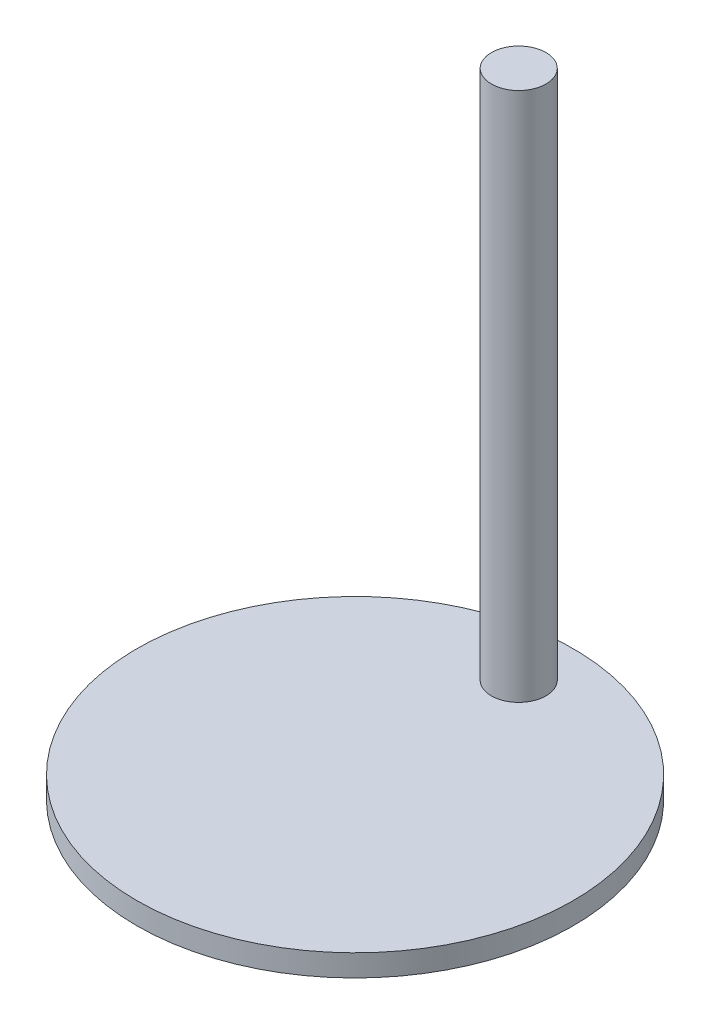
ISO-10303-21;
HEADER;
FILE_DESCRIPTION(('STEP AP214'),'2;1');
FILE_NAME('part.step','',(''),(''),'','','');
FILE_SCHEMA(('AUTOMOTIVE_DESIGN { 1 0 10303 214 1 1 1 1 }'));
ENDSEC;
DATA;
#1=APPLICATION_CONTEXT('core data for automotive mechanical design processes');
#2=APPLICATION_PROTOCOL_DEFINITION('international standard','automotive_design',2000,#1);
#3=PRODUCT_CONTEXT('',#1,'mechanical');
#4=PRODUCT('Part','Part','',(#3));
#5=PRODUCT_RELATED_PRODUCT_CATEGORY('part','',(#4));
#6=PRODUCT_DEFINITION_FORMATION('','',#4);
#7=PRODUCT_DEFINITION_CONTEXT('part definition',#1,'design');
#8=PRODUCT_DEFINITION('design','',#6,#7);
#9=PRODUCT_DEFINITION_SHAPE('','',#8);
#10=(LENGTH_UNIT() NAMED_UNIT(*) SI_UNIT(.MILLI.,.METRE.));
#11=(NAMED_UNIT(*) PLANE_ANGLE_UNIT() SI_UNIT($,.RADIAN.));
#12=(NAMED_UNIT(*) SI_UNIT($,.STERADIAN.) SOLID_ANGLE_UNIT());
#13=UNCERTAINTY_MEASURE_WITH_UNIT(LENGTH_MEASURE(1.E-05),#10,'distance_accuracy_value','');
#14=(GEOMETRIC_REPRESENTATION_CONTEXT(3) GLOBAL_UNCERTAINTY_ASSIGNED_CONTEXT((#13)) GLOBAL_UNIT_ASSIGNED_CONTEXT((#10,
#11,#12)) REPRESENTATION_CONTEXT('',''));
#15=CARTESIAN_POINT('',(0.,0.,0.));
#16=DIRECTION('',(0.,0.,1.));
#17=DIRECTION('',(1.,0.,0.));
#18=AXIS2_PLACEMENT_3D('',#15,#16,#17);
#19=CARTESIAN_POINT('',(0.,0.508,0.));
#20=DIRECTION('',(0.,1.,0.));
#21=DIRECTION('',(0.,0.,1.));
#22=AXIS2_PLACEMENT_3D('',#19,#20,#21);
#23=PLANE('',#22);
#24=CARTESIAN_POINT('',(0.,0.508,0.));
#25=DIRECTION('',(0.,1.,0.));
#26=DIRECTION('',(0.,0.,1.));
#27=AXIS2_PLACEMENT_3D('',#24,#25,#26);
#28=CIRCLE('',#27,5.08);
#29=CARTESIAN_POINT('',(0.,0.508,5.08));
#30=VERTEX_POINT('',#29);
#31=EDGE_CURVE('E10',#30,#30,#28,.T.);
#32=ORIENTED_EDGE('',*,*,#31,.T.);
#33=EDGE_LOOP('',(#32));
#34=FACE_BOUND('',#33,.T.);
#35=CARTESIAN_POINT('',(0.,0.508,-3.81));
#36=DIRECTION('',(0.,1.,0.));
#37=DIRECTION('',(0.,0.,1.));
#38=AXIS2_PLACEMENT_3D('',#35,#36,#37);
#39=CIRCLE('',#38,0.635);
#40=CARTESIAN_POINT('',(0.,0.508,-3.175));
#41=VERTEX_POINT('',#40);
#42=EDGE_CURVE('E43',#41,#41,#39,.T.);
#43=ORIENTED_EDGE('',*,*,#42,.F.);
#44=EDGE_LOOP('',(#43));
#45=FACE_BOUND('',#44,.T.);
#46=ADVANCED_FACE('F32',(#34,#45),#23,.T.);
#47=CARTESIAN_POINT('',(0.,0.,0.));
#48=DIRECTION('',(0.,1.,0.));
#49=DIRECTION('',(0.,0.,1.));
#50=AXIS2_PLACEMENT_3D('',#47,#48,#49);
#51=PLANE('',#50);
#52=CARTESIAN_POINT('',(0.,0.,0.));
#53=DIRECTION('',(0.,1.,0.));
#54=DIRECTION('',(0.,0.,1.));
#55=AXIS2_PLACEMENT_3D('',#52,#53,#54);
#56=CIRCLE('',#55,5.08);
#57=CARTESIAN_POINT('',(0.,0.,5.08));
#58=VERTEX_POINT('',#57);
#59=EDGE_CURVE('E36',#58,#58,#56,.T.);
#60=ORIENTED_EDGE('',*,*,#59,.F.);
#61=EDGE_LOOP('',(#60));
#62=FACE_BOUND('',#61,.T.);
#63=ADVANCED_FACE('F62',(#62),#51,.F.);
#64=CARTESIAN_POINT('',(0.,0.508,0.));
#65=DIRECTION('',(0.,-1.,0.));
#66=DIRECTION('',(0.,0.,-1.));
#67=AXIS2_PLACEMENT_3D('',#64,#65,#66);
#68=CYLINDRICAL_SURFACE('',#67,5.08);
#69=ORIENTED_EDGE('',*,*,#31,.F.);
#70=EDGE_LOOP('',(#69));
#71=FACE_BOUND('',#70,.T.);
#72=ORIENTED_EDGE('',*,*,#59,.T.);
#73=EDGE_LOOP('',(#72));
#74=FACE_BOUND('',#73,.T.);
#75=ADVANCED_FACE('F34',(#71,#74),#68,.T.);
#76=CARTESIAN_POINT('',(0.,12.8445076181177,-3.81));
#77=DIRECTION('',(0.,-1.,0.));
#78=DIRECTION('',(0.,0.,-1.));
#79=AXIS2_PLACEMENT_3D('',#76,#77,#78);
#80=CYLINDRICAL_SURFACE('',#79,0.635);
#81=ORIENTED_EDGE('',*,*,#42,.T.);
#82=EDGE_LOOP('',(#81));
#83=FACE_BOUND('',#82,.T.);
#84=CARTESIAN_POINT('',(0.,12.8445076181177,-3.81));
#85=DIRECTION('',(0.,1.,0.));
#86=DIRECTION('',(0.,0.,1.));
#87=AXIS2_PLACEMENT_3D('',#84,#85,#86);
#88=CIRCLE('',#87,0.635);
#89=CARTESIAN_POINT('',(0.,12.8445076181177,-3.175));
#90=VERTEX_POINT('',#89);
#91=EDGE_CURVE('E47',#90,#90,#88,.T.);
#92=ORIENTED_EDGE('',*,*,#91,.F.);
#93=EDGE_LOOP('',(#92));
#94=FACE_BOUND('',#93,.T.);
#95=ADVANCED_FACE('F53',(#83,#94),#80,.T.);
#96=CARTESIAN_POINT('',(0.,12.8445076181177,-3.81));
#97=DIRECTION('',(0.,1.,0.));
#98=DIRECTION('',(0.,0.,1.));
#99=AXIS2_PLACEMENT_3D('',#96,#97,#98);
#100=PLANE('',#99);
#101=ORIENTED_EDGE('',*,*,#91,.T.);
#102=EDGE_LOOP('',(#101));
#103=FACE_BOUND('',#102,.T.);
#104=ADVANCED_FACE('F51',(#103),#100,.T.);
#105=CLOSED_SHELL('',(#46,#63,#75,#95,#104));
#106=MANIFOLD_SOLID_BREP('B2',#105);
#107=ADVANCED_BREP_SHAPE_REPRESENTATION('',(#18,#106),#14);
#108=SHAPE_DEFINITION_REPRESENTATION(#9,#107);
ENDSEC;
END-ISO-10303-21;
